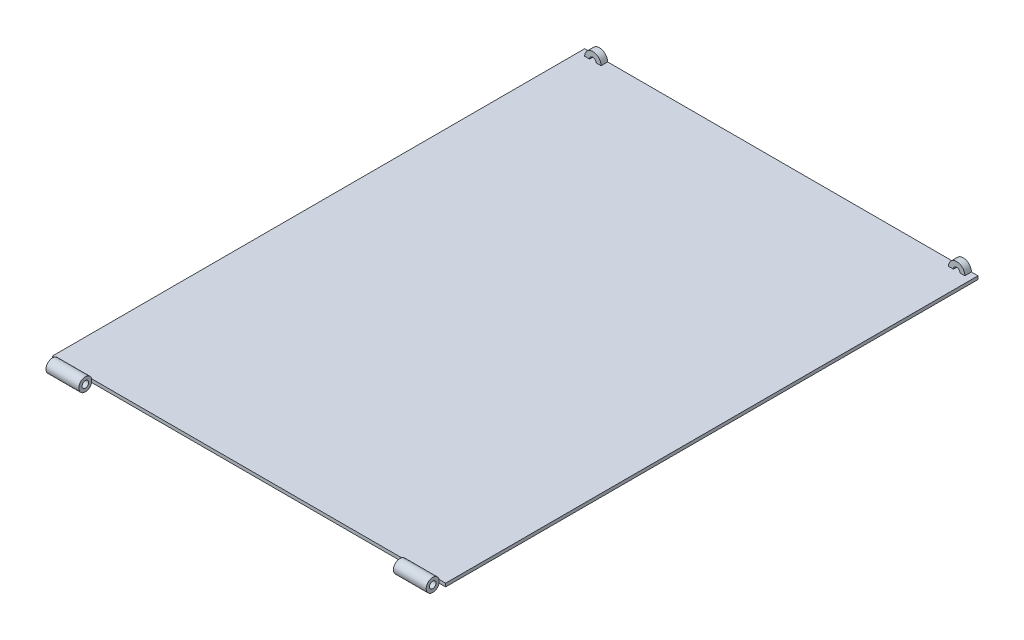
ISO-10303-21;
HEADER;
FILE_DESCRIPTION(('STEP AP214'),'2;1');
FILE_NAME('part.step','',(''),(''),'','','');
FILE_SCHEMA(('AUTOMOTIVE_DESIGN { 1 0 10303 214 1 1 1 1 }'));
ENDSEC;
DATA;
#1=APPLICATION_CONTEXT('core data for automotive mechanical design processes');
#2=APPLICATION_PROTOCOL_DEFINITION('international standard','automotive_design',2000,#1);
#3=PRODUCT_CONTEXT('',#1,'mechanical');
#4=PRODUCT('Part','Part','',(#3));
#5=PRODUCT_RELATED_PRODUCT_CATEGORY('part','',(#4));
#6=PRODUCT_DEFINITION_FORMATION('','',#4);
#7=PRODUCT_DEFINITION_CONTEXT('part definition',#1,'design');
#8=PRODUCT_DEFINITION('design','',#6,#7);
#9=PRODUCT_DEFINITION_SHAPE('','',#8);
#10=(LENGTH_UNIT() NAMED_UNIT(*) SI_UNIT(.MILLI.,.METRE.));
#11=(NAMED_UNIT(*) PLANE_ANGLE_UNIT() SI_UNIT($,.RADIAN.));
#12=(NAMED_UNIT(*) SI_UNIT($,.STERADIAN.) SOLID_ANGLE_UNIT());
#13=UNCERTAINTY_MEASURE_WITH_UNIT(LENGTH_MEASURE(1.E-05),#10,'distance_accuracy_value','');
#14=(GEOMETRIC_REPRESENTATION_CONTEXT(3) GLOBAL_UNCERTAINTY_ASSIGNED_CONTEXT((#13)) GLOBAL_UNIT_ASSIGNED_CONTEXT((#10,
#11,#12)) REPRESENTATION_CONTEXT('',''));
#15=CARTESIAN_POINT('',(0.,0.,0.));
#16=DIRECTION('',(0.,0.,1.));
#17=DIRECTION('',(1.,0.,0.));
#18=AXIS2_PLACEMENT_3D('',#15,#16,#17);
#19=CARTESIAN_POINT('',(0.,0.5,0.));
#20=DIRECTION('',(0.,1.,0.));
#21=DIRECTION('',(0.,0.,1.));
#22=AXIS2_PLACEMENT_3D('',#19,#20,#21);
#23=PLANE('',#22);
#24=DIRECTION('',(1.,0.,0.));
#25=VECTOR('',#24,1.);
#26=CARTESIAN_POINT('',(-29.,0.499999999999962,-40.09));
#27=LINE('',#26,#25);
#28=CARTESIAN_POINT('',(-29.,0.5,-40.09));
#29=VERTEX_POINT('',#28);
#30=CARTESIAN_POINT('',(-28.25,0.5,-40.09));
#31=VERTEX_POINT('',#30);
#32=EDGE_CURVE('E68',#29,#31,#27,.T.);
#33=ORIENTED_EDGE('',*,*,#32,.F.);
#34=DIRECTION('',(0.,0.,-1.));
#35=VECTOR('',#34,1.);
#36=CARTESIAN_POINT('',(-29.,0.499999999999962,-40.09));
#37=LINE('',#36,#35);
#38=CARTESIAN_POINT('',(-29.,0.499999999999962,-41.09));
#39=VERTEX_POINT('',#38);
#40=EDGE_CURVE('E192',#29,#39,#37,.T.);
#41=ORIENTED_EDGE('',*,*,#40,.T.);
#42=DIRECTION('',(-1.,0.,0.));
#43=VECTOR('',#42,1.);
#44=CARTESIAN_POINT('',(-30.,0.5,-41.09));
#45=LINE('',#44,#43);
#46=CARTESIAN_POINT('',(-30.,0.5,-41.09));
#47=VERTEX_POINT('',#46);
#48=EDGE_CURVE('E168',#39,#47,#45,.T.);
#49=ORIENTED_EDGE('',*,*,#48,.T.);
#50=DIRECTION('',(0.,0.,1.));
#51=VECTOR('',#50,1.);
#52=CARTESIAN_POINT('',(-30.,0.5,-41.09));
#53=LINE('',#52,#51);
#54=CARTESIAN_POINT('',(-30.,0.499999999999962,40.1217541634481));
#55=VERTEX_POINT('',#54);
#56=EDGE_CURVE('E283',#47,#55,#53,.T.);
#57=ORIENTED_EDGE('',*,*,#56,.T.);
#58=DIRECTION('',(-1.,0.,0.));
#59=VECTOR('',#58,1.);
#60=CARTESIAN_POINT('',(32.8284271247462,0.5,40.1217541634481));
#61=LINE('',#60,#59);
#62=CARTESIAN_POINT('',(-29.,0.499999999999962,40.1217541634481));
#63=VERTEX_POINT('',#62);
#64=EDGE_CURVE('E277',#55,#63,#61,.F.);
#65=ORIENTED_EDGE('',*,*,#64,.T.);
#66=CARTESIAN_POINT('',(-24.,0.499999999999962,40.1217541634481));
#67=VERTEX_POINT('',#66);
#68=EDGE_CURVE('E282',#63,#67,#61,.F.);
#69=ORIENTED_EDGE('',*,*,#68,.T.);
#70=CARTESIAN_POINT('',(24.,0.499999999999962,40.1217541634481));
#71=VERTEX_POINT('',#70);
#72=EDGE_CURVE('E348',#67,#71,#61,.F.);
#73=ORIENTED_EDGE('',*,*,#72,.T.);
#74=CARTESIAN_POINT('',(29.,0.499999999999962,40.1217541634481));
#75=VERTEX_POINT('',#74);
#76=EDGE_CURVE('E368',#71,#75,#61,.F.);
#77=ORIENTED_EDGE('',*,*,#76,.T.);
#78=CARTESIAN_POINT('',(30.,0.5,40.1217541634481));
#79=VERTEX_POINT('',#78);
#80=EDGE_CURVE('E276',#75,#79,#61,.F.);
#81=ORIENTED_EDGE('',*,*,#80,.T.);
#82=DIRECTION('',(0.,0.,-1.));
#83=VECTOR('',#82,1.);
#84=CARTESIAN_POINT('',(30.,0.5,-41.09));
#85=LINE('',#84,#83);
#86=CARTESIAN_POINT('',(30.,0.5,-41.09));
#87=VERTEX_POINT('',#86);
#88=EDGE_CURVE('E287',#79,#87,#85,.T.);
#89=ORIENTED_EDGE('',*,*,#88,.T.);
#90=CARTESIAN_POINT('',(29.,0.5,-41.09));
#91=VERTEX_POINT('',#90);
#92=EDGE_CURVE('E290',#87,#91,#45,.T.);
#93=ORIENTED_EDGE('',*,*,#92,.T.);
#94=DIRECTION('',(0.,0.,-1.));
#95=VECTOR('',#94,1.);
#96=CARTESIAN_POINT('',(29.,0.499999999999962,-40.09));
#97=LINE('',#96,#95);
#98=CARTESIAN_POINT('',(29.,0.5,-40.09));
#99=VERTEX_POINT('',#98);
#100=EDGE_CURVE('E216',#99,#91,#97,.T.);
#101=ORIENTED_EDGE('',*,*,#100,.F.);
#102=DIRECTION('',(-1.,0.,0.));
#103=VECTOR('',#102,1.);
#104=CARTESIAN_POINT('',(29.,0.499999999999962,-40.09));
#105=LINE('',#104,#103);
#106=CARTESIAN_POINT('',(28.25,0.5,-40.09));
#107=VERTEX_POINT('',#106);
#108=EDGE_CURVE('E205',#99,#107,#105,.T.);
#109=ORIENTED_EDGE('',*,*,#108,.T.);
#110=DIRECTION('',(0.,0.,-1.));
#111=VECTOR('',#110,1.);
#112=CARTESIAN_POINT('',(28.25,0.499999999999999,-40.09));
#113=LINE('',#112,#111);
#114=CARTESIAN_POINT('',(28.25,0.499999999999999,-41.09));
#115=VERTEX_POINT('',#114);
#116=EDGE_CURVE('E232',#107,#115,#113,.T.);
#117=ORIENTED_EDGE('',*,*,#116,.T.);
#118=CARTESIAN_POINT('',(27.25,0.5,-41.09));
#119=VERTEX_POINT('',#118);
#120=EDGE_CURVE('E294',#115,#119,#45,.T.);
#121=ORIENTED_EDGE('',*,*,#120,.T.);
#122=DIRECTION('',(0.,0.,-1.));
#123=VECTOR('',#122,1.);
#124=CARTESIAN_POINT('',(27.25,0.5,-40.09));
#125=LINE('',#124,#123);
#126=CARTESIAN_POINT('',(27.25,0.5,-40.09));
#127=VERTEX_POINT('',#126);
#128=EDGE_CURVE('E228',#127,#119,#125,.T.);
#129=ORIENTED_EDGE('',*,*,#128,.F.);
#130=DIRECTION('',(-1.,0.,0.));
#131=VECTOR('',#130,1.);
#132=CARTESIAN_POINT('',(27.25,0.5,-40.09));
#133=LINE('',#132,#131);
#134=CARTESIAN_POINT('',(26.5,0.5,-40.09));
#135=VERTEX_POINT('',#134);
#136=EDGE_CURVE('E213',#127,#135,#133,.T.);
#137=ORIENTED_EDGE('',*,*,#136,.T.);
#138=DIRECTION('',(0.,0.,-1.));
#139=VECTOR('',#138,1.);
#140=CARTESIAN_POINT('',(26.5,0.499999999999962,-40.09));
#141=LINE('',#140,#139);
#142=CARTESIAN_POINT('',(26.5,0.499999999999962,-41.09));
#143=VERTEX_POINT('',#142);
#144=EDGE_CURVE('E223',#135,#143,#141,.T.);
#145=ORIENTED_EDGE('',*,*,#144,.T.);
#146=CARTESIAN_POINT('',(-26.5,0.5,-41.09));
#147=VERTEX_POINT('',#146);
#148=EDGE_CURVE('E167',#143,#147,#45,.T.);
#149=ORIENTED_EDGE('',*,*,#148,.T.);
#150=DIRECTION('',(0.,0.,-1.));
#151=VECTOR('',#150,1.);
#152=CARTESIAN_POINT('',(-26.5,0.499999999999962,-40.09));
#153=LINE('',#152,#151);
#154=CARTESIAN_POINT('',(-26.5,0.5,-40.09));
#155=VERTEX_POINT('',#154);
#156=EDGE_CURVE('E178',#155,#147,#153,.T.);
#157=ORIENTED_EDGE('',*,*,#156,.F.);
#158=DIRECTION('',(1.,0.,0.));
#159=VECTOR('',#158,1.);
#160=CARTESIAN_POINT('',(-27.25,0.5,-40.09));
#161=LINE('',#160,#159);
#162=CARTESIAN_POINT('',(-27.25,0.5,-40.09));
#163=VERTEX_POINT('',#162);
#164=EDGE_CURVE('E173',#163,#155,#161,.T.);
#165=ORIENTED_EDGE('',*,*,#164,.F.);
#166=DIRECTION('',(0.,0.,-1.));
#167=VECTOR('',#166,1.);
#168=CARTESIAN_POINT('',(-27.25,0.5,-40.09));
#169=LINE('',#168,#167);
#170=CARTESIAN_POINT('',(-27.25,0.5,-41.09));
#171=VERTEX_POINT('',#170);
#172=EDGE_CURVE('E171',#163,#171,#169,.T.);
#173=ORIENTED_EDGE('',*,*,#172,.T.);
#174=CARTESIAN_POINT('',(-28.25,0.5,-41.09));
#175=VERTEX_POINT('',#174);
#176=EDGE_CURVE('E160',#171,#175,#45,.T.);
#177=ORIENTED_EDGE('',*,*,#176,.T.);
#178=DIRECTION('',(0.,0.,-1.));
#179=VECTOR('',#178,1.);
#180=CARTESIAN_POINT('',(-28.25,0.499999999999999,-40.09));
#181=LINE('',#180,#179);
#182=EDGE_CURVE('E64',#31,#175,#181,.T.);
#183=ORIENTED_EDGE('',*,*,#182,.F.);
#184=EDGE_LOOP('',(#33,#41,#49,#57,#65,#69,#73,#77,#81,#89,#93,#101,#109,#117,#121,#129,#137,
#145,#149,#157,#165,#173,#177,#183));
#185=FACE_BOUND('',#184,.T.);
#186=ADVANCED_FACE('F45',(#185),#23,.T.);
#187=CARTESIAN_POINT('',(32.8284271247462,0.25,41.09));
#188=DIRECTION('',(-1.,0.,0.));
#189=DIRECTION('',(0.,0.,1.));
#190=AXIS2_PLACEMENT_3D('',#187,#188,#189);
#191=CYLINDRICAL_SURFACE('',#190,0.999999999999998);
#192=DIRECTION('',(-1.,0.,0.));
#193=VECTOR('',#192,1.);
#194=CARTESIAN_POINT('',(32.8284271247462,0.,40.1217541634481));
#195=LINE('',#194,#193);
#196=CARTESIAN_POINT('',(24.,0.,40.1217541634481));
#197=VERTEX_POINT('',#196);
#198=CARTESIAN_POINT('',(29.,0.,40.1217541634481));
#199=VERTEX_POINT('',#198);
#200=EDGE_CURVE('E355',#197,#199,#195,.F.);
#201=ORIENTED_EDGE('',*,*,#200,.T.);
#202=CARTESIAN_POINT('',(29.,0.25,41.09));
#203=DIRECTION('',(-1.,0.,0.));
#204=DIRECTION('',(0.,0.,1.));
#205=AXIS2_PLACEMENT_3D('',#202,#203,#204);
#206=CIRCLE('',#205,0.999999999999998);
#207=EDGE_CURVE('E273',#199,#75,#206,.T.);
#208=ORIENTED_EDGE('',*,*,#207,.T.);
#209=ORIENTED_EDGE('',*,*,#76,.F.);
#210=CARTESIAN_POINT('',(24.,0.25,41.09));
#211=DIRECTION('',(1.,0.,0.));
#212=DIRECTION('',(0.,0.,-1.));
#213=AXIS2_PLACEMENT_3D('',#210,#211,#212);
#214=CIRCLE('',#213,0.999999999999998);
#215=EDGE_CURVE('E262',#71,#197,#214,.T.);
#216=ORIENTED_EDGE('',*,*,#215,.T.);
#217=EDGE_LOOP('',(#201,#208,#209,#216));
#218=FACE_BOUND('',#217,.T.);
#219=ADVANCED_FACE('F390',(#218),#191,.T.);
#220=CARTESIAN_POINT('',(0.,0.,0.));
#221=DIRECTION('',(0.,1.,0.));
#222=DIRECTION('',(0.,0.,1.));
#223=AXIS2_PLACEMENT_3D('',#220,#221,#222);
#224=PLANE('',#223);
#225=CARTESIAN_POINT('',(-30.,0.,40.1217541634481));
#226=VERTEX_POINT('',#225);
#227=CARTESIAN_POINT('',(-29.,0.,40.1217541634481));
#228=VERTEX_POINT('',#227);
#229=EDGE_CURVE('E11',#226,#228,#195,.F.);
#230=ORIENTED_EDGE('',*,*,#229,.F.);
#231=DIRECTION('',(0.,0.,1.));
#232=VECTOR('',#231,1.);
#233=CARTESIAN_POINT('',(-30.,0.,-41.09));
#234=LINE('',#233,#232);
#235=CARTESIAN_POINT('',(-30.,0.,-41.09));
#236=VERTEX_POINT('',#235);
#237=EDGE_CURVE('E281',#236,#226,#234,.T.);
#238=ORIENTED_EDGE('',*,*,#237,.F.);
#239=DIRECTION('',(-1.,0.,0.));
#240=VECTOR('',#239,1.);
#241=CARTESIAN_POINT('',(-30.,0.,-41.09));
#242=LINE('',#241,#240);
#243=CARTESIAN_POINT('',(30.,0.,-41.09));
#244=VERTEX_POINT('',#243);
#245=EDGE_CURVE('E288',#244,#236,#242,.T.);
#246=ORIENTED_EDGE('',*,*,#245,.F.);
#247=DIRECTION('',(0.,0.,-1.));
#248=VECTOR('',#247,1.);
#249=CARTESIAN_POINT('',(30.,0.,-41.09));
#250=LINE('',#249,#248);
#251=CARTESIAN_POINT('',(30.,0.,40.1217541634481));
#252=VERTEX_POINT('',#251);
#253=EDGE_CURVE('E298',#252,#244,#250,.T.);
#254=ORIENTED_EDGE('',*,*,#253,.F.);
#255=EDGE_CURVE('E57',#199,#252,#195,.F.);
#256=ORIENTED_EDGE('',*,*,#255,.F.);
#257=ORIENTED_EDGE('',*,*,#200,.F.);
#258=CARTESIAN_POINT('',(-24.,0.,40.1217541634481));
#259=VERTEX_POINT('',#258);
#260=EDGE_CURVE('E345',#259,#197,#195,.F.);
#261=ORIENTED_EDGE('',*,*,#260,.F.);
#262=EDGE_CURVE('E55',#228,#259,#195,.F.);
#263=ORIENTED_EDGE('',*,*,#262,.F.);
#264=EDGE_LOOP('',(#230,#238,#246,#254,#256,#257,#261,#263));
#265=FACE_BOUND('',#264,.T.);
#266=ADVANCED_FACE('F352',(#265),#224,.F.);
#267=CARTESIAN_POINT('',(-30.,0.5,-41.09));
#268=DIRECTION('',(1.,0.,0.));
#269=DIRECTION('',(0.,0.,-1.));
#270=AXIS2_PLACEMENT_3D('',#267,#268,#269);
#271=PLANE('',#270);
#272=ORIENTED_EDGE('',*,*,#237,.T.);
#273=DIRECTION('',(0.,1.,0.));
#274=VECTOR('',#273,1.);
#275=CARTESIAN_POINT('',(-30.,-0.749999999999998,40.1217541634481));
#276=LINE('',#275,#274);
#277=EDGE_CURVE('E244',#226,#55,#276,.T.);
#278=ORIENTED_EDGE('',*,*,#277,.T.);
#279=ORIENTED_EDGE('',*,*,#56,.F.);
#280=DIRECTION('',(0.,-1.,0.));
#281=VECTOR('',#280,1.);
#282=CARTESIAN_POINT('',(-30.,0.5,-41.09));
#283=LINE('',#282,#281);
#284=EDGE_CURVE('E293',#47,#236,#283,.T.);
#285=ORIENTED_EDGE('',*,*,#284,.T.);
#286=EDGE_LOOP('',(#272,#278,#279,#285));
#287=FACE_BOUND('',#286,.T.);
#288=ADVANCED_FACE('F47',(#287),#271,.F.);
#289=CARTESIAN_POINT('',(30.,0.5,-41.09));
#290=DIRECTION('',(-1.,0.,0.));
#291=DIRECTION('',(0.,0.,1.));
#292=AXIS2_PLACEMENT_3D('',#289,#290,#291);
#293=PLANE('',#292);
#294=ORIENTED_EDGE('',*,*,#88,.F.);
#295=DIRECTION('',(0.,1.,0.));
#296=VECTOR('',#295,1.);
#297=CARTESIAN_POINT('',(30.,-0.749999999999998,40.1217541634481));
#298=LINE('',#297,#296);
#299=EDGE_CURVE('E248',#252,#79,#298,.T.);
#300=ORIENTED_EDGE('',*,*,#299,.F.);
#301=ORIENTED_EDGE('',*,*,#253,.T.);
#302=DIRECTION('',(0.,-1.,0.));
#303=VECTOR('',#302,1.);
#304=CARTESIAN_POINT('',(30.,0.5,-41.09));
#305=LINE('',#304,#303);
#306=EDGE_CURVE('E306',#87,#244,#305,.T.);
#307=ORIENTED_EDGE('',*,*,#306,.F.);
#308=EDGE_LOOP('',(#294,#300,#301,#307));
#309=FACE_BOUND('',#308,.T.);
#310=ADVANCED_FACE('F404',(#309),#293,.F.);
#311=CARTESIAN_POINT('',(-30.,0.5,-41.09));
#312=DIRECTION('',(0.,0.,1.));
#313=DIRECTION('',(1.,0.,0.));
#314=AXIS2_PLACEMENT_3D('',#311,#312,#313);
#315=PLANE('',#314);
#316=CARTESIAN_POINT('',(-27.75,0.5,-41.09));
#317=DIRECTION('',(0.,0.,-1.));
#318=DIRECTION('',(-1.,0.,0.));
#319=AXIS2_PLACEMENT_3D('',#316,#317,#318);
#320=CIRCLE('',#319,0.5);
#321=EDGE_CURVE('E165',#175,#171,#320,.T.);
#322=ORIENTED_EDGE('',*,*,#321,.F.);
#323=ORIENTED_EDGE('',*,*,#176,.F.);
#324=EDGE_LOOP('',(#322,#323));
#325=FACE_BOUND('',#324,.T.);
#326=ORIENTED_EDGE('',*,*,#148,.F.);
#327=CARTESIAN_POINT('',(27.75,0.5,-41.09));
#328=DIRECTION('',(0.,0.,-1.));
#329=DIRECTION('',(1.,0.,0.));
#330=AXIS2_PLACEMENT_3D('',#327,#328,#329);
#331=CIRCLE('',#330,1.25);
#332=EDGE_CURVE('E195',#143,#91,#331,.T.);
#333=ORIENTED_EDGE('',*,*,#332,.T.);
#334=ORIENTED_EDGE('',*,*,#92,.F.);
#335=ORIENTED_EDGE('',*,*,#306,.T.);
#336=ORIENTED_EDGE('',*,*,#245,.T.);
#337=ORIENTED_EDGE('',*,*,#284,.F.);
#338=ORIENTED_EDGE('',*,*,#48,.F.);
#339=CARTESIAN_POINT('',(-27.75,0.5,-41.09));
#340=DIRECTION('',(0.,0.,1.));
#341=DIRECTION('',(-1.,0.,0.));
#342=AXIS2_PLACEMENT_3D('',#339,#340,#341);
#343=CIRCLE('',#342,1.25);
#344=EDGE_CURVE('E183',#147,#39,#343,.T.);
#345=ORIENTED_EDGE('',*,*,#344,.F.);
#346=EDGE_LOOP('',(#326,#333,#334,#335,#336,#337,#338,#345));
#347=FACE_BOUND('',#346,.T.);
#348=CARTESIAN_POINT('',(27.75,0.5,-41.09));
#349=DIRECTION('',(0.,0.,1.));
#350=DIRECTION('',(1.,0.,0.));
#351=AXIS2_PLACEMENT_3D('',#348,#349,#350);
#352=CIRCLE('',#351,0.5);
#353=EDGE_CURVE('E206',#115,#119,#352,.T.);
#354=ORIENTED_EDGE('',*,*,#353,.T.);
#355=ORIENTED_EDGE('',*,*,#120,.F.);
#356=EDGE_LOOP('',(#354,#355));
#357=FACE_BOUND('',#356,.T.);
#358=ADVANCED_FACE('F162',(#325,#347,#357),#315,.F.);
#359=ORIENTED_EDGE('',*,*,#68,.F.);
#360=CARTESIAN_POINT('',(-29.,0.25,41.09));
#361=DIRECTION('',(1.,0.,0.));
#362=DIRECTION('',(0.,0.,-1.));
#363=AXIS2_PLACEMENT_3D('',#360,#361,#362);
#364=CIRCLE('',#363,0.999999999999998);
#365=EDGE_CURVE('E270',#63,#228,#364,.T.);
#366=ORIENTED_EDGE('',*,*,#365,.T.);
#367=ORIENTED_EDGE('',*,*,#262,.T.);
#368=CARTESIAN_POINT('',(-24.,0.25,41.09));
#369=DIRECTION('',(-1.,0.,0.));
#370=DIRECTION('',(0.,0.,1.));
#371=AXIS2_PLACEMENT_3D('',#368,#369,#370);
#372=CIRCLE('',#371,0.999999999999998);
#373=EDGE_CURVE('E266',#259,#67,#372,.T.);
#374=ORIENTED_EDGE('',*,*,#373,.T.);
#375=EDGE_LOOP('',(#359,#366,#367,#374));
#376=FACE_BOUND('',#375,.T.);
#377=ADVANCED_FACE('F357',(#376),#191,.T.);
#378=CARTESIAN_POINT('',(-24.,-0.749999999999998,40.1217541634481));
#379=DIRECTION('',(0.,0.,-1.));
#380=DIRECTION('',(-1.,0.,0.));
#381=AXIS2_PLACEMENT_3D('',#378,#379,#380);
#382=PLANE('',#381);
#383=DIRECTION('',(0.,1.,0.));
#384=VECTOR('',#383,1.);
#385=CARTESIAN_POINT('',(24.,-0.749999999999998,40.1217541634481));
#386=LINE('',#385,#384);
#387=EDGE_CURVE('E243',#197,#71,#386,.T.);
#388=ORIENTED_EDGE('',*,*,#387,.T.);
#389=ORIENTED_EDGE('',*,*,#72,.F.);
#390=DIRECTION('',(0.,1.,0.));
#391=VECTOR('',#390,1.);
#392=CARTESIAN_POINT('',(-24.,-0.749999999999998,40.1217541634481));
#393=LINE('',#392,#391);
#394=EDGE_CURVE('E254',#259,#67,#393,.T.);
#395=ORIENTED_EDGE('',*,*,#394,.F.);
#396=ORIENTED_EDGE('',*,*,#260,.T.);
#397=EDGE_LOOP('',(#388,#389,#395,#396));
#398=FACE_BOUND('',#397,.T.);
#399=ADVANCED_FACE('F334',(#398),#382,.F.);
#400=CARTESIAN_POINT('',(-24.,-0.749999999999998,40.1217541634481));
#401=DIRECTION('',(-1.,0.,0.));
#402=DIRECTION('',(0.,0.,1.));
#403=AXIS2_PLACEMENT_3D('',#400,#401,#402);
#404=PLANE('',#403);
#405=CARTESIAN_POINT('',(-24.,0.25,41.09));
#406=DIRECTION('',(-1.,0.,0.));
#407=DIRECTION('',(0.,0.,1.));
#408=AXIS2_PLACEMENT_3D('',#405,#406,#407);
#409=CIRCLE('',#408,0.499999999999999);
#410=CARTESIAN_POINT('',(-24.,0.25,41.59));
#411=VERTEX_POINT('',#410);
#412=EDGE_CURVE('E265',#411,#411,#409,.T.);
#413=ORIENTED_EDGE('',*,*,#412,.T.);
#414=EDGE_LOOP('',(#413));
#415=FACE_BOUND('',#414,.T.);
#416=ORIENTED_EDGE('',*,*,#373,.F.);
#417=ORIENTED_EDGE('',*,*,#394,.T.);
#418=EDGE_LOOP('',(#416,#417));
#419=FACE_BOUND('',#418,.T.);
#420=ADVANCED_FACE('F331',(#415,#419),#404,.F.);
#421=CARTESIAN_POINT('',(24.,-0.749999999999998,40.1217541634481));
#422=DIRECTION('',(1.,0.,0.));
#423=DIRECTION('',(0.,0.,-1.));
#424=AXIS2_PLACEMENT_3D('',#421,#422,#423);
#425=PLANE('',#424);
#426=CARTESIAN_POINT('',(24.,0.25,41.09));
#427=DIRECTION('',(1.,0.,0.));
#428=DIRECTION('',(0.,0.,-1.));
#429=AXIS2_PLACEMENT_3D('',#426,#427,#428);
#430=CIRCLE('',#429,0.499999999999999);
#431=CARTESIAN_POINT('',(24.,0.25,40.59));
#432=VERTEX_POINT('',#431);
#433=EDGE_CURVE('E258',#432,#432,#430,.T.);
#434=ORIENTED_EDGE('',*,*,#433,.T.);
#435=EDGE_LOOP('',(#434));
#436=FACE_BOUND('',#435,.T.);
#437=ORIENTED_EDGE('',*,*,#387,.F.);
#438=ORIENTED_EDGE('',*,*,#215,.F.);
#439=EDGE_LOOP('',(#437,#438));
#440=FACE_BOUND('',#439,.T.);
#441=ADVANCED_FACE('F326',(#436,#440),#425,.F.);
#442=CARTESIAN_POINT('',(32.8284271247462,0.25,41.09));
#443=DIRECTION('',(-1.,0.,0.));
#444=DIRECTION('',(0.,0.,1.));
#445=AXIS2_PLACEMENT_3D('',#442,#443,#444);
#446=CYLINDRICAL_SURFACE('',#445,0.499999999999999);
#447=CARTESIAN_POINT('',(-29.,0.25,41.09));
#448=DIRECTION('',(1.,0.,0.));
#449=DIRECTION('',(0.,0.,-1.));
#450=AXIS2_PLACEMENT_3D('',#447,#448,#449);
#451=CIRCLE('',#450,0.499999999999999);
#452=CARTESIAN_POINT('',(-29.,0.25,40.59));
#453=VERTEX_POINT('',#452);
#454=EDGE_CURVE('E269',#453,#453,#451,.T.);
#455=ORIENTED_EDGE('',*,*,#454,.F.);
#456=EDGE_LOOP('',(#455));
#457=FACE_BOUND('',#456,.T.);
#458=ORIENTED_EDGE('',*,*,#412,.F.);
#459=EDGE_LOOP('',(#458));
#460=FACE_BOUND('',#459,.T.);
#461=ADVANCED_FACE('F322',(#457,#460),#446,.F.);
#462=CARTESIAN_POINT('',(-30.,-0.749999999999998,40.1217541634481));
#463=DIRECTION('',(0.,0.,-1.));
#464=DIRECTION('',(-1.,0.,0.));
#465=AXIS2_PLACEMENT_3D('',#462,#463,#464);
#466=PLANE('',#465);
#467=DIRECTION('',(0.,1.,0.));
#468=VECTOR('',#467,1.);
#469=CARTESIAN_POINT('',(-29.,-0.749999999999998,40.1217541634481));
#470=LINE('',#469,#468);
#471=EDGE_CURVE('E239',#228,#63,#470,.T.);
#472=ORIENTED_EDGE('',*,*,#471,.T.);
#473=ORIENTED_EDGE('',*,*,#64,.F.);
#474=ORIENTED_EDGE('',*,*,#277,.F.);
#475=ORIENTED_EDGE('',*,*,#229,.T.);
#476=EDGE_LOOP('',(#472,#473,#474,#475));
#477=FACE_BOUND('',#476,.T.);
#478=ADVANCED_FACE('F325',(#477),#466,.F.);
#479=CARTESIAN_POINT('',(-29.,-0.749999999999998,40.1217541634481));
#480=DIRECTION('',(1.,0.,0.));
#481=DIRECTION('',(0.,0.,-1.));
#482=AXIS2_PLACEMENT_3D('',#479,#480,#481);
#483=PLANE('',#482);
#484=ORIENTED_EDGE('',*,*,#454,.T.);
#485=EDGE_LOOP('',(#484));
#486=FACE_BOUND('',#485,.T.);
#487=ORIENTED_EDGE('',*,*,#471,.F.);
#488=ORIENTED_EDGE('',*,*,#365,.F.);
#489=EDGE_LOOP('',(#487,#488));
#490=FACE_BOUND('',#489,.T.);
#491=ADVANCED_FACE('F319',(#486,#490),#483,.F.);
#492=CARTESIAN_POINT('',(30.,-0.749999999999998,40.1217541634481));
#493=DIRECTION('',(0.,0.,-1.));
#494=DIRECTION('',(-1.,0.,0.));
#495=AXIS2_PLACEMENT_3D('',#492,#493,#494);
#496=PLANE('',#495);
#497=ORIENTED_EDGE('',*,*,#299,.T.);
#498=ORIENTED_EDGE('',*,*,#80,.F.);
#499=DIRECTION('',(0.,1.,0.));
#500=VECTOR('',#499,1.);
#501=CARTESIAN_POINT('',(29.,-0.749999999999998,40.1217541634481));
#502=LINE('',#501,#500);
#503=EDGE_CURVE('E227',#199,#75,#502,.T.);
#504=ORIENTED_EDGE('',*,*,#503,.F.);
#505=ORIENTED_EDGE('',*,*,#255,.T.);
#506=EDGE_LOOP('',(#497,#498,#504,#505));
#507=FACE_BOUND('',#506,.T.);
#508=ADVANCED_FACE('F407',(#507),#496,.F.);
#509=CARTESIAN_POINT('',(29.,-0.749999999999998,40.1217541634481));
#510=DIRECTION('',(-1.,0.,0.));
#511=DIRECTION('',(0.,0.,1.));
#512=AXIS2_PLACEMENT_3D('',#509,#510,#511);
#513=PLANE('',#512);
#514=CARTESIAN_POINT('',(29.,0.25,41.09));
#515=DIRECTION('',(-1.,0.,0.));
#516=DIRECTION('',(0.,0.,1.));
#517=AXIS2_PLACEMENT_3D('',#514,#515,#516);
#518=CIRCLE('',#517,0.499999999999999);
#519=CARTESIAN_POINT('',(29.,0.25,41.59));
#520=VERTEX_POINT('',#519);
#521=EDGE_CURVE('E49',#520,#520,#518,.T.);
#522=ORIENTED_EDGE('',*,*,#521,.T.);
#523=EDGE_LOOP('',(#522));
#524=FACE_BOUND('',#523,.T.);
#525=ORIENTED_EDGE('',*,*,#207,.F.);
#526=ORIENTED_EDGE('',*,*,#503,.T.);
#527=EDGE_LOOP('',(#525,#526));
#528=FACE_BOUND('',#527,.T.);
#529=ADVANCED_FACE('F376',(#524,#528),#513,.F.);
#530=ORIENTED_EDGE('',*,*,#521,.F.);
#531=EDGE_LOOP('',(#530));
#532=FACE_BOUND('',#531,.T.);
#533=ORIENTED_EDGE('',*,*,#433,.F.);
#534=EDGE_LOOP('',(#533));
#535=FACE_BOUND('',#534,.T.);
#536=ADVANCED_FACE('F328',(#532,#535),#446,.F.);
#537=CARTESIAN_POINT('',(27.75,0.5,-40.09));
#538=DIRECTION('',(0.,0.,-1.));
#539=DIRECTION('',(-1.,0.,0.));
#540=AXIS2_PLACEMENT_3D('',#537,#538,#539);
#541=CYLINDRICAL_SURFACE('',#540,1.25);
#542=ORIENTED_EDGE('',*,*,#332,.F.);
#543=ORIENTED_EDGE('',*,*,#144,.F.);
#544=CARTESIAN_POINT('',(27.75,0.5,-40.09));
#545=DIRECTION('',(0.,0.,-1.));
#546=DIRECTION('',(1.,0.,0.));
#547=AXIS2_PLACEMENT_3D('',#544,#545,#546);
#548=CIRCLE('',#547,1.25);
#549=EDGE_CURVE('E201',#135,#99,#548,.T.);
#550=ORIENTED_EDGE('',*,*,#549,.T.);
#551=ORIENTED_EDGE('',*,*,#100,.T.);
#552=EDGE_LOOP('',(#542,#543,#550,#551));
#553=FACE_BOUND('',#552,.T.);
#554=ADVANCED_FACE('F381',(#553),#541,.T.);
#555=CARTESIAN_POINT('',(27.75,0.5,-40.09));
#556=DIRECTION('',(0.,0.,-1.));
#557=DIRECTION('',(-1.,0.,0.));
#558=AXIS2_PLACEMENT_3D('',#555,#556,#557);
#559=CYLINDRICAL_SURFACE('',#558,0.5);
#560=ORIENTED_EDGE('',*,*,#353,.F.);
#561=ORIENTED_EDGE('',*,*,#116,.F.);
#562=CARTESIAN_POINT('',(27.75,0.5,-40.09));
#563=DIRECTION('',(0.,0.,1.));
#564=DIRECTION('',(1.,0.,0.));
#565=AXIS2_PLACEMENT_3D('',#562,#563,#564);
#566=CIRCLE('',#565,0.5);
#567=EDGE_CURVE('E209',#107,#127,#566,.T.);
#568=ORIENTED_EDGE('',*,*,#567,.T.);
#569=ORIENTED_EDGE('',*,*,#128,.T.);
#570=EDGE_LOOP('',(#560,#561,#568,#569));
#571=FACE_BOUND('',#570,.T.);
#572=ADVANCED_FACE('F422',(#571),#559,.F.);
#573=CARTESIAN_POINT('',(27.75,0.5,-40.09));
#574=DIRECTION('',(0.,0.,1.));
#575=DIRECTION('',(1.,0.,0.));
#576=AXIS2_PLACEMENT_3D('',#573,#574,#575);
#577=PLANE('',#576);
#578=ORIENTED_EDGE('',*,*,#549,.F.);
#579=ORIENTED_EDGE('',*,*,#136,.F.);
#580=ORIENTED_EDGE('',*,*,#567,.F.);
#581=ORIENTED_EDGE('',*,*,#108,.F.);
#582=EDGE_LOOP('',(#578,#579,#580,#581));
#583=FACE_BOUND('',#582,.T.);
#584=ADVANCED_FACE('F417',(#583),#577,.T.);
#585=CARTESIAN_POINT('',(-27.75,0.5,-40.09));
#586=DIRECTION('',(0.,0.,-1.));
#587=DIRECTION('',(-1.,0.,0.));
#588=AXIS2_PLACEMENT_3D('',#585,#586,#587);
#589=CYLINDRICAL_SURFACE('',#588,1.25);
#590=ORIENTED_EDGE('',*,*,#344,.T.);
#591=ORIENTED_EDGE('',*,*,#40,.F.);
#592=CARTESIAN_POINT('',(-27.75,0.5,-40.09));
#593=DIRECTION('',(0.,0.,1.));
#594=DIRECTION('',(-1.,0.,0.));
#595=AXIS2_PLACEMENT_3D('',#592,#593,#594);
#596=CIRCLE('',#595,1.25);
#597=EDGE_CURVE('E182',#155,#29,#596,.T.);
#598=ORIENTED_EDGE('',*,*,#597,.F.);
#599=ORIENTED_EDGE('',*,*,#156,.T.);
#600=EDGE_LOOP('',(#590,#591,#598,#599));
#601=FACE_BOUND('',#600,.T.);
#602=ADVANCED_FACE('F547',(#601),#589,.T.);
#603=CARTESIAN_POINT('',(-27.75,0.5,-40.09));
#604=DIRECTION('',(0.,0.,-1.));
#605=DIRECTION('',(-1.,0.,0.));
#606=AXIS2_PLACEMENT_3D('',#603,#604,#605);
#607=CYLINDRICAL_SURFACE('',#606,0.5);
#608=ORIENTED_EDGE('',*,*,#321,.T.);
#609=ORIENTED_EDGE('',*,*,#172,.F.);
#610=CARTESIAN_POINT('',(-27.75,0.5,-40.09));
#611=DIRECTION('',(0.,0.,-1.));
#612=DIRECTION('',(-1.,0.,0.));
#613=AXIS2_PLACEMENT_3D('',#610,#611,#612);
#614=CIRCLE('',#613,0.5);
#615=EDGE_CURVE('E700',#31,#163,#614,.T.);
#616=ORIENTED_EDGE('',*,*,#615,.F.);
#617=ORIENTED_EDGE('',*,*,#182,.T.);
#618=EDGE_LOOP('',(#608,#609,#616,#617));
#619=FACE_BOUND('',#618,.T.);
#620=ADVANCED_FACE('F180',(#619),#607,.F.);
#621=CARTESIAN_POINT('',(-27.75,0.5,-40.09));
#622=DIRECTION('',(0.,0.,1.));
#623=DIRECTION('',(-1.,0.,0.));
#624=AXIS2_PLACEMENT_3D('',#621,#622,#623);
#625=PLANE('',#624);
#626=ORIENTED_EDGE('',*,*,#597,.T.);
#627=ORIENTED_EDGE('',*,*,#32,.T.);
#628=ORIENTED_EDGE('',*,*,#615,.T.);
#629=ORIENTED_EDGE('',*,*,#164,.T.);
#630=EDGE_LOOP('',(#626,#627,#628,#629));
#631=FACE_BOUND('',#630,.T.);
#632=ADVANCED_FACE('F564',(#631),#625,.T.);
#633=CLOSED_SHELL('',(#186,#219,#266,#288,#310,#358,#377,#399,#420,#441,#461,#478,#491,#508,
#529,#536,#554,#572,#584,#602,#620,#632));
#634=MANIFOLD_SOLID_BREP('B2',#633);
#635=ADVANCED_BREP_SHAPE_REPRESENTATION('',(#18,#634),#14);
#636=SHAPE_DEFINITION_REPRESENTATION(#9,#635);
ENDSEC;
END-ISO-10303-21;
